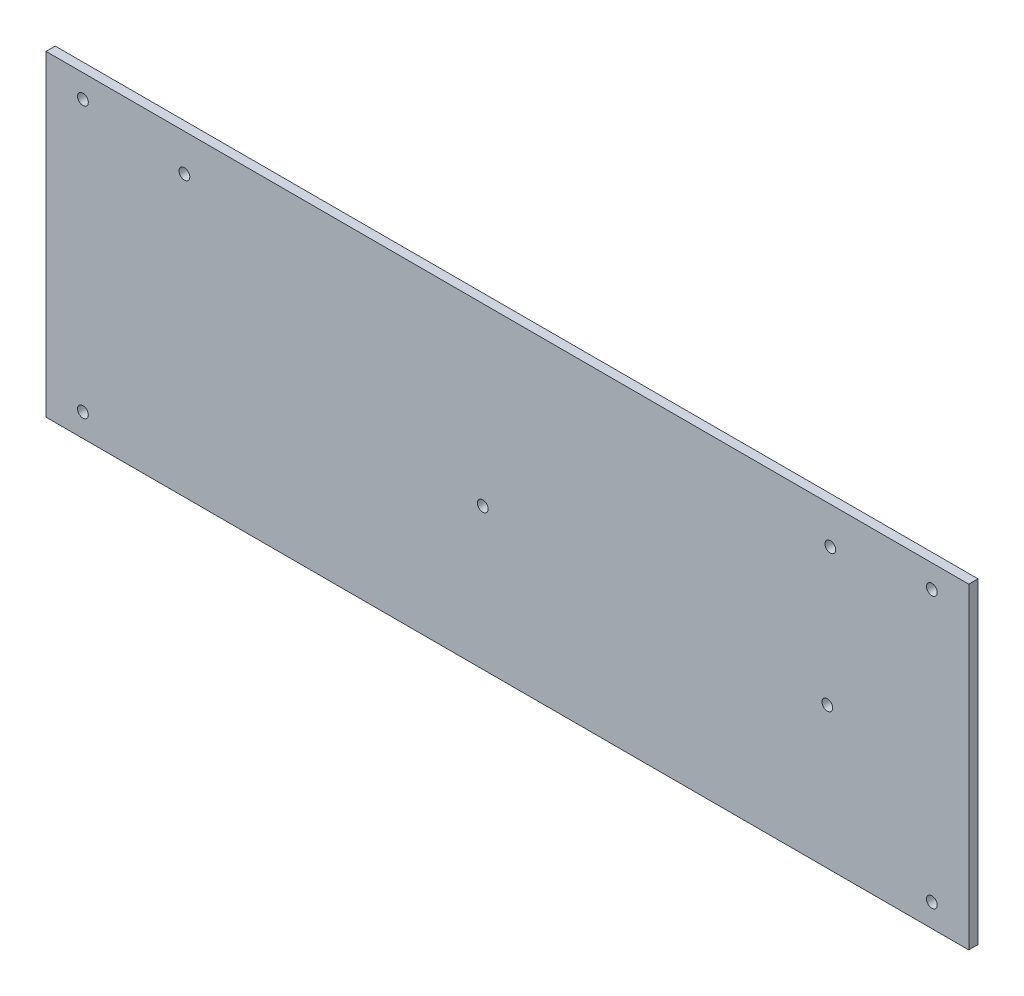
ISO-10303-21;
HEADER;
FILE_DESCRIPTION(('STEP AP214'),'2;1');
FILE_NAME('part.step','',(''),(''),'','','');
FILE_SCHEMA(('AUTOMOTIVE_DESIGN { 1 0 10303 214 1 1 1 1 }'));
ENDSEC;
DATA;
#1=APPLICATION_CONTEXT('core data for automotive mechanical design processes');
#2=APPLICATION_PROTOCOL_DEFINITION('international standard','automotive_design',2000,#1);
#3=PRODUCT_CONTEXT('',#1,'mechanical');
#4=PRODUCT('Part','Part','',(#3));
#5=PRODUCT_RELATED_PRODUCT_CATEGORY('part','',(#4));
#6=PRODUCT_DEFINITION_FORMATION('','',#4);
#7=PRODUCT_DEFINITION_CONTEXT('part definition',#1,'design');
#8=PRODUCT_DEFINITION('design','',#6,#7);
#9=PRODUCT_DEFINITION_SHAPE('','',#8);
#10=(LENGTH_UNIT() NAMED_UNIT(*) SI_UNIT(.MILLI.,.METRE.));
#11=(NAMED_UNIT(*) PLANE_ANGLE_UNIT() SI_UNIT($,.RADIAN.));
#12=(NAMED_UNIT(*) SI_UNIT($,.STERADIAN.) SOLID_ANGLE_UNIT());
#13=UNCERTAINTY_MEASURE_WITH_UNIT(LENGTH_MEASURE(1.E-05),#10,'distance_accuracy_value','');
#14=(GEOMETRIC_REPRESENTATION_CONTEXT(3) GLOBAL_UNCERTAINTY_ASSIGNED_CONTEXT((#13)) GLOBAL_UNIT_ASSIGNED_CONTEXT((#10,
#11,#12)) REPRESENTATION_CONTEXT('',''));
#15=CARTESIAN_POINT('',(0.,0.,0.));
#16=DIRECTION('',(0.,0.,1.));
#17=DIRECTION('',(1.,0.,0.));
#18=AXIS2_PLACEMENT_3D('',#15,#16,#17);
#19=CARTESIAN_POINT('',(0.,0.,0.));
#20=DIRECTION('',(0.,0.,-1.));
#21=DIRECTION('',(-1.,0.,0.));
#22=AXIS2_PLACEMENT_3D('',#19,#20,#21);
#23=PLANE('',#22);
#24=DIRECTION('',(0.,1.,0.));
#25=VECTOR('',#24,1.);
#26=CARTESIAN_POINT('',(300.,0.,0.));
#27=LINE('',#26,#25);
#28=CARTESIAN_POINT('',(300.,100.,0.));
#29=VERTEX_POINT('',#28);
#30=CARTESIAN_POINT('',(300.,-3.,0.));
#31=VERTEX_POINT('',#30);
#32=EDGE_CURVE('E56',#29,#31,#27,.F.);
#33=ORIENTED_EDGE('',*,*,#32,.T.);
#34=DIRECTION('',(1.,0.,0.));
#35=VECTOR('',#34,1.);
#36=CARTESIAN_POINT('',(0.,-3.,0.));
#37=LINE('',#36,#35);
#38=CARTESIAN_POINT('',(0.,-3.,0.));
#39=VERTEX_POINT('',#38);
#40=EDGE_CURVE('E307',#31,#39,#37,.F.);
#41=ORIENTED_EDGE('',*,*,#40,.T.);
#42=DIRECTION('',(0.,1.,0.));
#43=VECTOR('',#42,1.);
#44=CARTESIAN_POINT('',(0.,0.,0.));
#45=LINE('',#44,#43);
#46=CARTESIAN_POINT('',(0.,100.,0.));
#47=VERTEX_POINT('',#46);
#48=EDGE_CURVE('E61',#39,#47,#45,.T.);
#49=ORIENTED_EDGE('',*,*,#48,.T.);
#50=DIRECTION('',(1.,0.,0.));
#51=VECTOR('',#50,1.);
#52=CARTESIAN_POINT('',(0.,100.,0.));
#53=LINE('',#52,#51);
#54=EDGE_CURVE('E59',#47,#29,#53,.T.);
#55=ORIENTED_EDGE('',*,*,#54,.T.);
#56=EDGE_LOOP('',(#33,#41,#49,#55));
#57=FACE_BOUND('',#56,.T.);
#58=CARTESIAN_POINT('',(142.,43.,0.));
#59=DIRECTION('',(0.,0.,1.));
#60=DIRECTION('',(1.,0.,0.));
#61=AXIS2_PLACEMENT_3D('',#58,#59,#60);
#62=CIRCLE('',#61,1.75);
#63=CARTESIAN_POINT('',(143.75,43.,0.));
#64=VERTEX_POINT('',#63);
#65=EDGE_CURVE('E67',#64,#64,#62,.T.);
#66=ORIENTED_EDGE('',*,*,#65,.T.);
#67=EDGE_LOOP('',(#66));
#68=FACE_BOUND('',#67,.T.);
#69=CARTESIAN_POINT('',(254.,43.,0.));
#70=DIRECTION('',(0.,0.,1.));
#71=DIRECTION('',(1.,0.,0.));
#72=AXIS2_PLACEMENT_3D('',#69,#70,#71);
#73=CIRCLE('',#72,1.75000000000003);
#74=CARTESIAN_POINT('',(255.75,43.,0.));
#75=VERTEX_POINT('',#74);
#76=EDGE_CURVE('E108',#75,#75,#73,.T.);
#77=ORIENTED_EDGE('',*,*,#76,.T.);
#78=EDGE_LOOP('',(#77));
#79=FACE_BOUND('',#78,.T.);
#80=CARTESIAN_POINT('',(288.,92.5,0.));
#81=DIRECTION('',(0.,0.,-1.));
#82=DIRECTION('',(-1.,0.,0.));
#83=AXIS2_PLACEMENT_3D('',#80,#81,#82);
#84=CIRCLE('',#83,1.74999999999997);
#85=CARTESIAN_POINT('',(286.25,92.5,0.));
#86=VERTEX_POINT('',#85);
#87=EDGE_CURVE('E111',#86,#86,#84,.F.);
#88=ORIENTED_EDGE('',*,*,#87,.T.);
#89=EDGE_LOOP('',(#88));
#90=FACE_BOUND('',#89,.T.);
#91=CARTESIAN_POINT('',(12.,4.50000000000003,0.));
#92=DIRECTION('',(0.,0.,-1.));
#93=DIRECTION('',(-1.,0.,0.));
#94=AXIS2_PLACEMENT_3D('',#91,#92,#93);
#95=CIRCLE('',#94,1.74999999999998);
#96=CARTESIAN_POINT('',(10.25,4.50000000000003,0.));
#97=VERTEX_POINT('',#96);
#98=EDGE_CURVE('E114',#97,#97,#95,.F.);
#99=ORIENTED_EDGE('',*,*,#98,.T.);
#100=EDGE_LOOP('',(#99));
#101=FACE_BOUND('',#100,.T.);
#102=CARTESIAN_POINT('',(12.,92.5,0.));
#103=DIRECTION('',(0.,0.,-1.));
#104=DIRECTION('',(-1.,0.,0.));
#105=AXIS2_PLACEMENT_3D('',#102,#103,#104);
#106=CIRCLE('',#105,1.74999999999998);
#107=CARTESIAN_POINT('',(10.25,92.5,0.));
#108=VERTEX_POINT('',#107);
#109=EDGE_CURVE('E117',#108,#108,#106,.F.);
#110=ORIENTED_EDGE('',*,*,#109,.T.);
#111=EDGE_LOOP('',(#110));
#112=FACE_BOUND('',#111,.T.);
#113=CARTESIAN_POINT('',(288.,4.5,0.));
#114=DIRECTION('',(0.,0.,-1.));
#115=DIRECTION('',(-1.,0.,0.));
#116=AXIS2_PLACEMENT_3D('',#113,#114,#115);
#117=CIRCLE('',#116,1.74999999999997);
#118=CARTESIAN_POINT('',(286.25,4.5,0.));
#119=VERTEX_POINT('',#118);
#120=EDGE_CURVE('E120',#119,#119,#117,.F.);
#121=ORIENTED_EDGE('',*,*,#120,.T.);
#122=EDGE_LOOP('',(#121));
#123=FACE_BOUND('',#122,.T.);
#124=CARTESIAN_POINT('',(45.,88.,0.));
#125=DIRECTION('',(0.,0.,-1.));
#126=DIRECTION('',(-1.,0.,0.));
#127=AXIS2_PLACEMENT_3D('',#124,#125,#126);
#128=CIRCLE('',#127,1.75);
#129=CARTESIAN_POINT('',(43.25,88.,0.));
#130=VERTEX_POINT('',#129);
#131=EDGE_CURVE('E122',#130,#130,#128,.F.);
#132=ORIENTED_EDGE('',*,*,#131,.T.);
#133=EDGE_LOOP('',(#132));
#134=FACE_BOUND('',#133,.T.);
#135=CARTESIAN_POINT('',(255.,88.,0.));
#136=DIRECTION('',(0.,0.,-1.));
#137=DIRECTION('',(-1.,0.,0.));
#138=AXIS2_PLACEMENT_3D('',#135,#136,#137);
#139=CIRCLE('',#138,1.74999999999997);
#140=CARTESIAN_POINT('',(253.25,88.,0.));
#141=VERTEX_POINT('',#140);
#142=EDGE_CURVE('E21',#141,#141,#139,.F.);
#143=ORIENTED_EDGE('',*,*,#142,.T.);
#144=EDGE_LOOP('',(#143));
#145=FACE_BOUND('',#144,.T.);
#146=ADVANCED_FACE('F18',(#57,#68,#79,#90,#101,#112,#123,#134,#145),#23,.T.);
#147=CARTESIAN_POINT('',(255.,88.,3.00000000000004));
#148=DIRECTION('',(0.,0.,-1.));
#149=DIRECTION('',(-1.,0.,0.));
#150=AXIS2_PLACEMENT_3D('',#147,#148,#149);
#151=CYLINDRICAL_SURFACE('',#150,1.74999999999997);
#152=CARTESIAN_POINT('',(255.,88.,3.00000000000004));
#153=DIRECTION('',(0.,0.,-1.));
#154=DIRECTION('',(-1.,0.,0.));
#155=AXIS2_PLACEMENT_3D('',#152,#153,#154);
#156=CIRCLE('',#155,1.74999999999997);
#157=CARTESIAN_POINT('',(253.25,88.,3.00000000000004));
#158=VERTEX_POINT('',#157);
#159=EDGE_CURVE('E103',#158,#158,#156,.F.);
#160=ORIENTED_EDGE('',*,*,#159,.T.);
#161=EDGE_LOOP('',(#160));
#162=FACE_BOUND('',#161,.T.);
#163=ORIENTED_EDGE('',*,*,#142,.F.);
#164=EDGE_LOOP('',(#163));
#165=FACE_BOUND('',#164,.T.);
#166=ADVANCED_FACE('F130',(#162,#165),#151,.F.);
#167=CARTESIAN_POINT('',(45.,88.,3.00000000000004));
#168=DIRECTION('',(0.,0.,-1.));
#169=DIRECTION('',(-1.,0.,0.));
#170=AXIS2_PLACEMENT_3D('',#167,#168,#169);
#171=CYLINDRICAL_SURFACE('',#170,1.75);
#172=CARTESIAN_POINT('',(45.,88.,3.00000000000004));
#173=DIRECTION('',(0.,0.,-1.));
#174=DIRECTION('',(-1.,0.,0.));
#175=AXIS2_PLACEMENT_3D('',#172,#173,#174);
#176=CIRCLE('',#175,1.75);
#177=CARTESIAN_POINT('',(43.25,88.,3.00000000000004));
#178=VERTEX_POINT('',#177);
#179=EDGE_CURVE('E100',#178,#178,#176,.F.);
#180=ORIENTED_EDGE('',*,*,#179,.T.);
#181=EDGE_LOOP('',(#180));
#182=FACE_BOUND('',#181,.T.);
#183=ORIENTED_EDGE('',*,*,#131,.F.);
#184=EDGE_LOOP('',(#183));
#185=FACE_BOUND('',#184,.T.);
#186=ADVANCED_FACE('F132',(#182,#185),#171,.F.);
#187=CARTESIAN_POINT('',(288.,4.5,3.));
#188=DIRECTION('',(0.,0.,-1.));
#189=DIRECTION('',(-1.,0.,0.));
#190=AXIS2_PLACEMENT_3D('',#187,#188,#189);
#191=CYLINDRICAL_SURFACE('',#190,1.74999999999997);
#192=CARTESIAN_POINT('',(288.,4.5,3.));
#193=DIRECTION('',(0.,0.,-1.));
#194=DIRECTION('',(-1.,0.,0.));
#195=AXIS2_PLACEMENT_3D('',#192,#193,#194);
#196=CIRCLE('',#195,1.74999999999997);
#197=CARTESIAN_POINT('',(286.25,4.5,3.));
#198=VERTEX_POINT('',#197);
#199=EDGE_CURVE('E97',#198,#198,#196,.F.);
#200=ORIENTED_EDGE('',*,*,#199,.T.);
#201=EDGE_LOOP('',(#200));
#202=FACE_BOUND('',#201,.T.);
#203=ORIENTED_EDGE('',*,*,#120,.F.);
#204=EDGE_LOOP('',(#203));
#205=FACE_BOUND('',#204,.T.);
#206=ADVANCED_FACE('F139',(#202,#205),#191,.F.);
#207=CARTESIAN_POINT('',(12.,92.5,3.));
#208=DIRECTION('',(0.,0.,-1.));
#209=DIRECTION('',(-1.,0.,0.));
#210=AXIS2_PLACEMENT_3D('',#207,#208,#209);
#211=CYLINDRICAL_SURFACE('',#210,1.74999999999998);
#212=CARTESIAN_POINT('',(12.,92.5,3.));
#213=DIRECTION('',(0.,0.,-1.));
#214=DIRECTION('',(-1.,0.,0.));
#215=AXIS2_PLACEMENT_3D('',#212,#213,#214);
#216=CIRCLE('',#215,1.74999999999998);
#217=CARTESIAN_POINT('',(10.25,92.5,3.));
#218=VERTEX_POINT('',#217);
#219=EDGE_CURVE('E94',#218,#218,#216,.F.);
#220=ORIENTED_EDGE('',*,*,#219,.T.);
#221=EDGE_LOOP('',(#220));
#222=FACE_BOUND('',#221,.T.);
#223=ORIENTED_EDGE('',*,*,#109,.F.);
#224=EDGE_LOOP('',(#223));
#225=FACE_BOUND('',#224,.T.);
#226=ADVANCED_FACE('F177',(#222,#225),#211,.F.);
#227=CARTESIAN_POINT('',(12.,4.50000000000003,3.));
#228=DIRECTION('',(0.,0.,-1.));
#229=DIRECTION('',(-1.,0.,0.));
#230=AXIS2_PLACEMENT_3D('',#227,#228,#229);
#231=CYLINDRICAL_SURFACE('',#230,1.74999999999998);
#232=CARTESIAN_POINT('',(12.,4.50000000000003,3.));
#233=DIRECTION('',(0.,0.,-1.));
#234=DIRECTION('',(-1.,0.,0.));
#235=AXIS2_PLACEMENT_3D('',#232,#233,#234);
#236=CIRCLE('',#235,1.74999999999998);
#237=CARTESIAN_POINT('',(10.25,4.50000000000003,3.));
#238=VERTEX_POINT('',#237);
#239=EDGE_CURVE('E91',#238,#238,#236,.F.);
#240=ORIENTED_EDGE('',*,*,#239,.T.);
#241=EDGE_LOOP('',(#240));
#242=FACE_BOUND('',#241,.T.);
#243=ORIENTED_EDGE('',*,*,#98,.F.);
#244=EDGE_LOOP('',(#243));
#245=FACE_BOUND('',#244,.T.);
#246=ADVANCED_FACE('F173',(#242,#245),#231,.F.);
#247=CARTESIAN_POINT('',(288.,92.5,3.));
#248=DIRECTION('',(0.,0.,-1.));
#249=DIRECTION('',(-1.,0.,0.));
#250=AXIS2_PLACEMENT_3D('',#247,#248,#249);
#251=CYLINDRICAL_SURFACE('',#250,1.74999999999997);
#252=CARTESIAN_POINT('',(288.,92.5,3.));
#253=DIRECTION('',(0.,0.,-1.));
#254=DIRECTION('',(-1.,0.,0.));
#255=AXIS2_PLACEMENT_3D('',#252,#253,#254);
#256=CIRCLE('',#255,1.74999999999997);
#257=CARTESIAN_POINT('',(286.25,92.5,3.));
#258=VERTEX_POINT('',#257);
#259=EDGE_CURVE('E88',#258,#258,#256,.F.);
#260=ORIENTED_EDGE('',*,*,#259,.T.);
#261=EDGE_LOOP('',(#260));
#262=FACE_BOUND('',#261,.T.);
#263=ORIENTED_EDGE('',*,*,#87,.F.);
#264=EDGE_LOOP('',(#263));
#265=FACE_BOUND('',#264,.T.);
#266=ADVANCED_FACE('F169',(#262,#265),#251,.F.);
#267=CARTESIAN_POINT('',(254.,43.,-27.));
#268=DIRECTION('',(0.,0.,1.));
#269=DIRECTION('',(1.,0.,0.));
#270=AXIS2_PLACEMENT_3D('',#267,#268,#269);
#271=CYLINDRICAL_SURFACE('',#270,1.75000000000003);
#272=ORIENTED_EDGE('',*,*,#76,.F.);
#273=EDGE_LOOP('',(#272));
#274=FACE_BOUND('',#273,.T.);
#275=CARTESIAN_POINT('',(254.,43.,3.));
#276=DIRECTION('',(0.,0.,1.));
#277=DIRECTION('',(1.,0.,0.));
#278=AXIS2_PLACEMENT_3D('',#275,#276,#277);
#279=CIRCLE('',#278,1.75000000000003);
#280=CARTESIAN_POINT('',(255.75,43.,3.));
#281=VERTEX_POINT('',#280);
#282=EDGE_CURVE('E85',#281,#281,#279,.T.);
#283=ORIENTED_EDGE('',*,*,#282,.T.);
#284=EDGE_LOOP('',(#283));
#285=FACE_BOUND('',#284,.T.);
#286=ADVANCED_FACE('F165',(#274,#285),#271,.F.);
#287=CARTESIAN_POINT('',(142.,43.,-27.));
#288=DIRECTION('',(0.,0.,1.));
#289=DIRECTION('',(1.,0.,0.));
#290=AXIS2_PLACEMENT_3D('',#287,#288,#289);
#291=CYLINDRICAL_SURFACE('',#290,1.75);
#292=ORIENTED_EDGE('',*,*,#65,.F.);
#293=EDGE_LOOP('',(#292));
#294=FACE_BOUND('',#293,.T.);
#295=CARTESIAN_POINT('',(142.,43.,3.));
#296=DIRECTION('',(0.,0.,1.));
#297=DIRECTION('',(1.,0.,0.));
#298=AXIS2_PLACEMENT_3D('',#295,#296,#297);
#299=CIRCLE('',#298,1.75);
#300=CARTESIAN_POINT('',(143.75,43.,3.));
#301=VERTEX_POINT('',#300);
#302=EDGE_CURVE('E82',#301,#301,#299,.T.);
#303=ORIENTED_EDGE('',*,*,#302,.T.);
#304=EDGE_LOOP('',(#303));
#305=FACE_BOUND('',#304,.T.);
#306=ADVANCED_FACE('F162',(#294,#305),#291,.F.);
#307=CARTESIAN_POINT('',(0.,100.,3.));
#308=DIRECTION('',(0.,-1.,0.));
#309=DIRECTION('',(0.,0.,-1.));
#310=AXIS2_PLACEMENT_3D('',#307,#308,#309);
#311=PLANE('',#310);
#312=DIRECTION('',(0.,0.,-1.));
#313=VECTOR('',#312,1.);
#314=CARTESIAN_POINT('',(0.,100.,3.));
#315=LINE('',#314,#313);
#316=CARTESIAN_POINT('',(0.,100.,3.));
#317=VERTEX_POINT('',#316);
#318=EDGE_CURVE('E309',#47,#317,#315,.F.);
#319=ORIENTED_EDGE('',*,*,#318,.T.);
#320=DIRECTION('',(-1.,0.,0.));
#321=VECTOR('',#320,1.);
#322=CARTESIAN_POINT('',(0.,100.,3.));
#323=LINE('',#322,#321);
#324=CARTESIAN_POINT('',(300.,100.,3.00000000000001));
#325=VERTEX_POINT('',#324);
#326=EDGE_CURVE('E78',#317,#325,#323,.F.);
#327=ORIENTED_EDGE('',*,*,#326,.T.);
#328=DIRECTION('',(0.,0.,1.));
#329=VECTOR('',#328,1.);
#330=CARTESIAN_POINT('',(300.,100.,3.));
#331=LINE('',#330,#329);
#332=EDGE_CURVE('E66',#325,#29,#331,.F.);
#333=ORIENTED_EDGE('',*,*,#332,.T.);
#334=ORIENTED_EDGE('',*,*,#54,.F.);
#335=EDGE_LOOP('',(#319,#327,#333,#334));
#336=FACE_BOUND('',#335,.T.);
#337=ADVANCED_FACE('F77',(#336),#311,.F.);
#338=CARTESIAN_POINT('',(300.,0.,3.));
#339=DIRECTION('',(-1.,0.,0.));
#340=DIRECTION('',(0.,0.,1.));
#341=AXIS2_PLACEMENT_3D('',#338,#339,#340);
#342=PLANE('',#341);
#343=ORIENTED_EDGE('',*,*,#332,.F.);
#344=DIRECTION('',(0.,1.,0.));
#345=VECTOR('',#344,1.);
#346=CARTESIAN_POINT('',(300.,0.,3.));
#347=LINE('',#346,#345);
#348=CARTESIAN_POINT('',(300.,-3.,3.00000000000002));
#349=VERTEX_POINT('',#348);
#350=EDGE_CURVE('E316',#325,#349,#347,.F.);
#351=ORIENTED_EDGE('',*,*,#350,.T.);
#352=DIRECTION('',(0.,0.,1.));
#353=VECTOR('',#352,1.);
#354=CARTESIAN_POINT('',(300.,-3.,0.));
#355=LINE('',#354,#353);
#356=EDGE_CURVE('E74',#349,#31,#355,.F.);
#357=ORIENTED_EDGE('',*,*,#356,.T.);
#358=ORIENTED_EDGE('',*,*,#32,.F.);
#359=EDGE_LOOP('',(#343,#351,#357,#358));
#360=FACE_BOUND('',#359,.T.);
#361=ADVANCED_FACE('F71',(#360),#342,.F.);
#362=CARTESIAN_POINT('',(0.,-3.,0.));
#363=DIRECTION('',(0.,1.,0.));
#364=DIRECTION('',(0.,0.,1.));
#365=AXIS2_PLACEMENT_3D('',#362,#363,#364);
#366=PLANE('',#365);
#367=ORIENTED_EDGE('',*,*,#40,.F.);
#368=ORIENTED_EDGE('',*,*,#356,.F.);
#369=DIRECTION('',(-1.,0.,0.));
#370=VECTOR('',#369,1.);
#371=CARTESIAN_POINT('',(0.,-3.,3.));
#372=LINE('',#371,#370);
#373=CARTESIAN_POINT('',(0.,-3.,3.));
#374=VERTEX_POINT('',#373);
#375=EDGE_CURVE('E27',#349,#374,#372,.T.);
#376=ORIENTED_EDGE('',*,*,#375,.T.);
#377=DIRECTION('',(0.,0.,-1.));
#378=VECTOR('',#377,1.);
#379=CARTESIAN_POINT('',(0.,-3.,3.));
#380=LINE('',#379,#378);
#381=EDGE_CURVE('E35',#374,#39,#380,.T.);
#382=ORIENTED_EDGE('',*,*,#381,.T.);
#383=EDGE_LOOP('',(#367,#368,#376,#382));
#384=FACE_BOUND('',#383,.T.);
#385=ADVANCED_FACE('F150',(#384),#366,.F.);
#386=CARTESIAN_POINT('',(0.,0.,3.));
#387=DIRECTION('',(1.,0.,0.));
#388=DIRECTION('',(0.,0.,-1.));
#389=AXIS2_PLACEMENT_3D('',#386,#387,#388);
#390=PLANE('',#389);
#391=ORIENTED_EDGE('',*,*,#381,.F.);
#392=DIRECTION('',(0.,1.,0.));
#393=VECTOR('',#392,1.);
#394=CARTESIAN_POINT('',(0.,0.,3.));
#395=LINE('',#394,#393);
#396=EDGE_CURVE('E11',#374,#317,#395,.T.);
#397=ORIENTED_EDGE('',*,*,#396,.T.);
#398=ORIENTED_EDGE('',*,*,#318,.F.);
#399=ORIENTED_EDGE('',*,*,#48,.F.);
#400=EDGE_LOOP('',(#391,#397,#398,#399));
#401=FACE_BOUND('',#400,.T.);
#402=ADVANCED_FACE('F144',(#401),#390,.F.);
#403=CARTESIAN_POINT('',(0.,0.,3.));
#404=DIRECTION('',(0.,0.,-1.));
#405=DIRECTION('',(-1.,0.,0.));
#406=AXIS2_PLACEMENT_3D('',#403,#404,#405);
#407=PLANE('',#406);
#408=ORIENTED_EDGE('',*,*,#375,.F.);
#409=ORIENTED_EDGE('',*,*,#350,.F.);
#410=ORIENTED_EDGE('',*,*,#326,.F.);
#411=ORIENTED_EDGE('',*,*,#396,.F.);
#412=EDGE_LOOP('',(#408,#409,#410,#411));
#413=FACE_BOUND('',#412,.T.);
#414=ORIENTED_EDGE('',*,*,#302,.F.);
#415=EDGE_LOOP('',(#414));
#416=FACE_BOUND('',#415,.T.);
#417=ORIENTED_EDGE('',*,*,#282,.F.);
#418=EDGE_LOOP('',(#417));
#419=FACE_BOUND('',#418,.T.);
#420=ORIENTED_EDGE('',*,*,#259,.F.);
#421=EDGE_LOOP('',(#420));
#422=FACE_BOUND('',#421,.T.);
#423=ORIENTED_EDGE('',*,*,#239,.F.);
#424=EDGE_LOOP('',(#423));
#425=FACE_BOUND('',#424,.T.);
#426=ORIENTED_EDGE('',*,*,#219,.F.);
#427=EDGE_LOOP('',(#426));
#428=FACE_BOUND('',#427,.T.);
#429=ORIENTED_EDGE('',*,*,#199,.F.);
#430=EDGE_LOOP('',(#429));
#431=FACE_BOUND('',#430,.T.);
#432=ORIENTED_EDGE('',*,*,#179,.F.);
#433=EDGE_LOOP('',(#432));
#434=FACE_BOUND('',#433,.T.);
#435=ORIENTED_EDGE('',*,*,#159,.F.);
#436=EDGE_LOOP('',(#435));
#437=FACE_BOUND('',#436,.T.);
#438=ADVANCED_FACE('F142',(#413,#416,#419,#422,#425,#428,#431,#434,#437),#407,.F.);
#439=CLOSED_SHELL('',(#146,#166,#186,#206,#226,#246,#266,#286,#306,#337,#361,#385,#402,#438));
#440=MANIFOLD_SOLID_BREP('B1',#439);
#441=ADVANCED_BREP_SHAPE_REPRESENTATION('',(#18,#440),#14);
#442=SHAPE_DEFINITION_REPRESENTATION(#9,#441);
ENDSEC;
END-ISO-10303-21;
